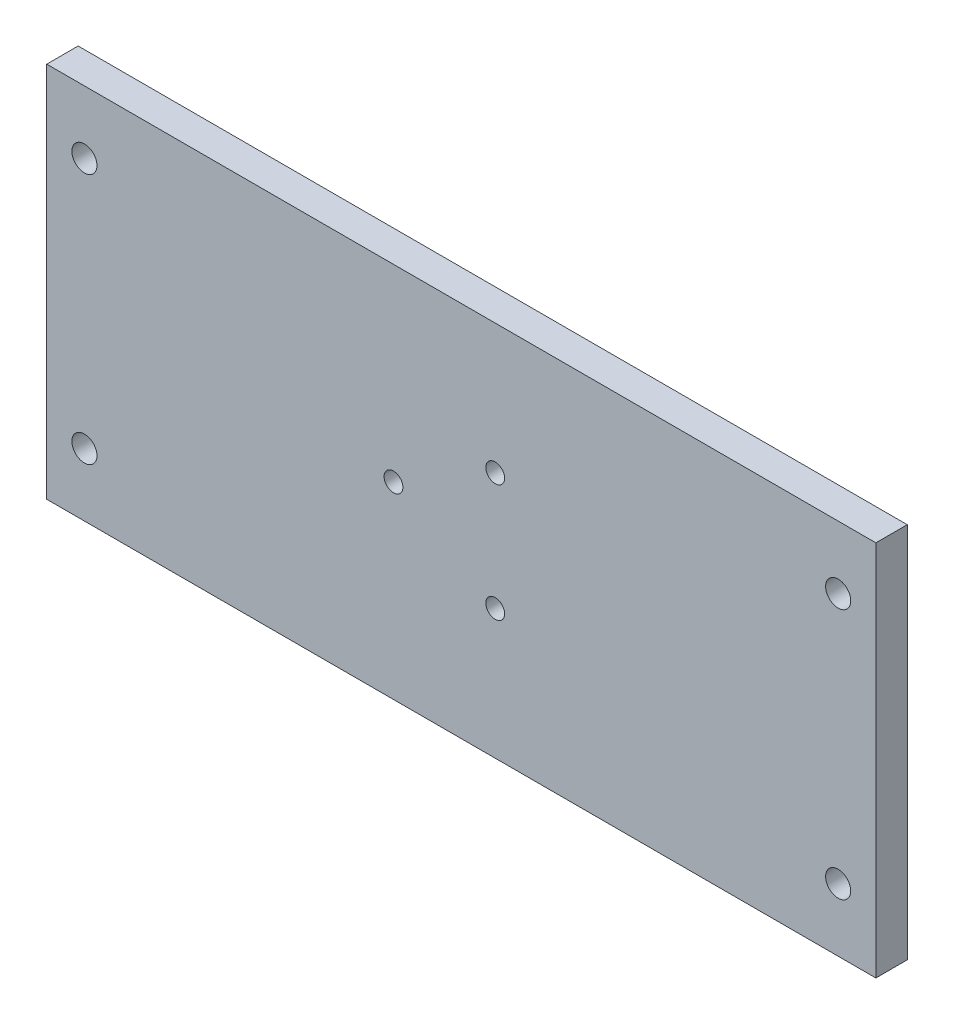
ISO-10303-21;
HEADER;
FILE_DESCRIPTION(('STEP AP214'),'2;1');
FILE_NAME('part.step','',(''),(''),'','','');
FILE_SCHEMA(('AUTOMOTIVE_DESIGN { 1 0 10303 214 1 1 1 1 }'));
ENDSEC;
DATA;
#1=APPLICATION_CONTEXT('core data for automotive mechanical design processes');
#2=APPLICATION_PROTOCOL_DEFINITION('international standard','automotive_design',2000,#1);
#3=PRODUCT_CONTEXT('',#1,'mechanical');
#4=PRODUCT('Part','Part','',(#3));
#5=PRODUCT_RELATED_PRODUCT_CATEGORY('part','',(#4));
#6=PRODUCT_DEFINITION_FORMATION('','',#4);
#7=PRODUCT_DEFINITION_CONTEXT('part definition',#1,'design');
#8=PRODUCT_DEFINITION('design','',#6,#7);
#9=PRODUCT_DEFINITION_SHAPE('','',#8);
#10=(LENGTH_UNIT() NAMED_UNIT(*) SI_UNIT(.MILLI.,.METRE.));
#11=(NAMED_UNIT(*) PLANE_ANGLE_UNIT() SI_UNIT($,.RADIAN.));
#12=(NAMED_UNIT(*) SI_UNIT($,.STERADIAN.) SOLID_ANGLE_UNIT());
#13=UNCERTAINTY_MEASURE_WITH_UNIT(LENGTH_MEASURE(1.E-05),#10,'distance_accuracy_value','');
#14=(GEOMETRIC_REPRESENTATION_CONTEXT(3) GLOBAL_UNCERTAINTY_ASSIGNED_CONTEXT((#13)) GLOBAL_UNIT_ASSIGNED_CONTEXT((#10,
#11,#12)) REPRESENTATION_CONTEXT('',''));
#15=CARTESIAN_POINT('',(0.,0.,0.));
#16=DIRECTION('',(0.,0.,1.));
#17=DIRECTION('',(1.,0.,0.));
#18=AXIS2_PLACEMENT_3D('',#15,#16,#17);
#19=CARTESIAN_POINT('',(-70.,30.,5.));
#20=DIRECTION('',(0.,-1.,0.));
#21=DIRECTION('',(0.,0.,-1.));
#22=AXIS2_PLACEMENT_3D('',#19,#20,#21);
#23=PLANE('',#22);
#24=DIRECTION('',(-1.,0.,0.));
#25=VECTOR('',#24,1.);
#26=CARTESIAN_POINT('',(-70.,30.,0.));
#27=LINE('',#26,#25);
#28=CARTESIAN_POINT('',(66.,30.,0.));
#29=VERTEX_POINT('',#28);
#30=CARTESIAN_POINT('',(-66.,30.,0.));
#31=VERTEX_POINT('',#30);
#32=EDGE_CURVE('E124',#29,#31,#27,.T.);
#33=ORIENTED_EDGE('',*,*,#32,.T.);
#34=DIRECTION('',(0.,0.,1.));
#35=VECTOR('',#34,1.);
#36=CARTESIAN_POINT('',(-66.,30.,0.));
#37=LINE('',#36,#35);
#38=CARTESIAN_POINT('',(-66.,30.,5.));
#39=VERTEX_POINT('',#38);
#40=EDGE_CURVE('E53',#31,#39,#37,.T.);
#41=ORIENTED_EDGE('',*,*,#40,.T.);
#42=DIRECTION('',(-1.,0.,0.));
#43=VECTOR('',#42,1.);
#44=CARTESIAN_POINT('',(-70.,30.,5.));
#45=LINE('',#44,#43);
#46=CARTESIAN_POINT('',(66.,30.,5.));
#47=VERTEX_POINT('',#46);
#48=EDGE_CURVE('E45',#47,#39,#45,.T.);
#49=ORIENTED_EDGE('',*,*,#48,.F.);
#50=DIRECTION('',(0.,0.,1.));
#51=VECTOR('',#50,1.);
#52=CARTESIAN_POINT('',(66.,30.,0.));
#53=LINE('',#52,#51);
#54=EDGE_CURVE('E94',#29,#47,#53,.T.);
#55=ORIENTED_EDGE('',*,*,#54,.F.);
#56=EDGE_LOOP('',(#33,#41,#49,#55));
#57=FACE_BOUND('',#56,.T.);
#58=ADVANCED_FACE('F37',(#57),#23,.F.);
#59=CARTESIAN_POINT('',(-70.,-30.,5.));
#60=DIRECTION('',(0.,1.,0.));
#61=DIRECTION('',(0.,0.,1.));
#62=AXIS2_PLACEMENT_3D('',#59,#60,#61);
#63=PLANE('',#62);
#64=DIRECTION('',(1.,0.,0.));
#65=VECTOR('',#64,1.);
#66=CARTESIAN_POINT('',(-70.,-30.,5.));
#67=LINE('',#66,#65);
#68=CARTESIAN_POINT('',(-66.,-30.,5.));
#69=VERTEX_POINT('',#68);
#70=CARTESIAN_POINT('',(66.,-30.,5.));
#71=VERTEX_POINT('',#70);
#72=EDGE_CURVE('E11',#69,#71,#67,.T.);
#73=ORIENTED_EDGE('',*,*,#72,.F.);
#74=DIRECTION('',(0.,0.,1.));
#75=VECTOR('',#74,1.);
#76=CARTESIAN_POINT('',(-66.,-30.,0.));
#77=LINE('',#76,#75);
#78=CARTESIAN_POINT('',(-66.,-30.,0.));
#79=VERTEX_POINT('',#78);
#80=EDGE_CURVE('E77',#79,#69,#77,.T.);
#81=ORIENTED_EDGE('',*,*,#80,.F.);
#82=DIRECTION('',(1.,0.,0.));
#83=VECTOR('',#82,1.);
#84=CARTESIAN_POINT('',(-70.,-30.,0.));
#85=LINE('',#84,#83);
#86=CARTESIAN_POINT('',(66.,-30.,0.));
#87=VERTEX_POINT('',#86);
#88=EDGE_CURVE('E40',#79,#87,#85,.T.);
#89=ORIENTED_EDGE('',*,*,#88,.T.);
#90=DIRECTION('',(0.,0.,1.));
#91=VECTOR('',#90,1.);
#92=CARTESIAN_POINT('',(66.,-30.,0.));
#93=LINE('',#92,#91);
#94=EDGE_CURVE('E61',#87,#71,#93,.T.);
#95=ORIENTED_EDGE('',*,*,#94,.T.);
#96=EDGE_LOOP('',(#73,#81,#89,#95));
#97=FACE_BOUND('',#96,.T.);
#98=ADVANCED_FACE('F93',(#97),#63,.F.);
#99=CARTESIAN_POINT('',(0.,0.,5.));
#100=DIRECTION('',(0.,0.,-1.));
#101=DIRECTION('',(-1.,0.,0.));
#102=AXIS2_PLACEMENT_3D('',#99,#100,#101);
#103=PLANE('',#102);
#104=CARTESIAN_POINT('',(5.39749999999992,-9.34874423385306,5.));
#105=DIRECTION('',(0.,0.,1.));
#106=DIRECTION('',(1.,0.,0.));
#107=AXIS2_PLACEMENT_3D('',#104,#105,#106);
#108=CIRCLE('',#107,1.5);
#109=CARTESIAN_POINT('',(6.89749999999991,-9.34874423385306,5.));
#110=VERTEX_POINT('',#109);
#111=EDGE_CURVE('E139',#110,#110,#108,.T.);
#112=ORIENTED_EDGE('',*,*,#111,.F.);
#113=EDGE_LOOP('',(#112));
#114=FACE_BOUND('',#113,.T.);
#115=CARTESIAN_POINT('',(5.39750000000004,9.34874423385299,5.));
#116=DIRECTION('',(0.,0.,1.));
#117=DIRECTION('',(1.,0.,0.));
#118=AXIS2_PLACEMENT_3D('',#115,#116,#117);
#119=CIRCLE('',#118,1.5);
#120=CARTESIAN_POINT('',(6.89750000000004,9.34874423385299,5.));
#121=VERTEX_POINT('',#120);
#122=EDGE_CURVE('E146',#121,#121,#119,.T.);
#123=ORIENTED_EDGE('',*,*,#122,.F.);
#124=EDGE_LOOP('',(#123));
#125=FACE_BOUND('',#124,.T.);
#126=CARTESIAN_POINT('',(-10.795,0.,5.));
#127=DIRECTION('',(0.,0.,1.));
#128=DIRECTION('',(1.,0.,0.));
#129=AXIS2_PLACEMENT_3D('',#126,#127,#128);
#130=CIRCLE('',#129,1.5);
#131=CARTESIAN_POINT('',(-9.295,0.,5.));
#132=VERTEX_POINT('',#131);
#133=EDGE_CURVE('E153',#132,#132,#130,.T.);
#134=ORIENTED_EDGE('',*,*,#133,.F.);
#135=EDGE_LOOP('',(#134));
#136=FACE_BOUND('',#135,.T.);
#137=CARTESIAN_POINT('',(60.,-20.,5.));
#138=DIRECTION('',(0.,0.,1.));
#139=DIRECTION('',(1.,0.,0.));
#140=AXIS2_PLACEMENT_3D('',#137,#138,#139);
#141=CIRCLE('',#140,2.);
#142=CARTESIAN_POINT('',(62.,-20.,5.));
#143=VERTEX_POINT('',#142);
#144=EDGE_CURVE('E109',#143,#143,#141,.T.);
#145=ORIENTED_EDGE('',*,*,#144,.F.);
#146=EDGE_LOOP('',(#145));
#147=FACE_BOUND('',#146,.T.);
#148=CARTESIAN_POINT('',(-60.,20.,5.));
#149=DIRECTION('',(0.,0.,1.));
#150=DIRECTION('',(1.,0.,0.));
#151=AXIS2_PLACEMENT_3D('',#148,#149,#150);
#152=CIRCLE('',#151,2.);
#153=CARTESIAN_POINT('',(-58.,20.,5.));
#154=VERTEX_POINT('',#153);
#155=EDGE_CURVE('E116',#154,#154,#152,.T.);
#156=ORIENTED_EDGE('',*,*,#155,.F.);
#157=EDGE_LOOP('',(#156));
#158=FACE_BOUND('',#157,.T.);
#159=CARTESIAN_POINT('',(-60.,-20.,5.));
#160=DIRECTION('',(0.,0.,1.));
#161=DIRECTION('',(1.,0.,0.));
#162=AXIS2_PLACEMENT_3D('',#159,#160,#161);
#163=CIRCLE('',#162,2.);
#164=CARTESIAN_POINT('',(-58.,-20.,5.));
#165=VERTEX_POINT('',#164);
#166=EDGE_CURVE('E102',#165,#165,#163,.T.);
#167=ORIENTED_EDGE('',*,*,#166,.F.);
#168=EDGE_LOOP('',(#167));
#169=FACE_BOUND('',#168,.T.);
#170=CARTESIAN_POINT('',(60.,20.,5.));
#171=DIRECTION('',(0.,0.,1.));
#172=DIRECTION('',(1.,0.,0.));
#173=AXIS2_PLACEMENT_3D('',#170,#171,#172);
#174=CIRCLE('',#173,2.);
#175=CARTESIAN_POINT('',(62.,20.,5.));
#176=VERTEX_POINT('',#175);
#177=EDGE_CURVE('E121',#176,#176,#174,.T.);
#178=ORIENTED_EDGE('',*,*,#177,.F.);
#179=EDGE_LOOP('',(#178));
#180=FACE_BOUND('',#179,.T.);
#181=ORIENTED_EDGE('',*,*,#48,.T.);
#182=DIRECTION('',(0.,1.,0.));
#183=VECTOR('',#182,1.);
#184=CARTESIAN_POINT('',(-66.,30.,5.));
#185=LINE('',#184,#183);
#186=EDGE_CURVE('E80',#69,#39,#185,.T.);
#187=ORIENTED_EDGE('',*,*,#186,.F.);
#188=ORIENTED_EDGE('',*,*,#72,.T.);
#189=DIRECTION('',(0.,-1.,0.));
#190=VECTOR('',#189,1.);
#191=CARTESIAN_POINT('',(66.,30.,5.));
#192=LINE('',#191,#190);
#193=EDGE_CURVE('E99',#47,#71,#192,.T.);
#194=ORIENTED_EDGE('',*,*,#193,.F.);
#195=EDGE_LOOP('',(#181,#187,#188,#194));
#196=FACE_BOUND('',#195,.T.);
#197=ADVANCED_FACE('F89',(#114,#125,#136,#147,#158,#169,#180,#196),#103,.F.);
#198=CARTESIAN_POINT('',(0.,0.,0.));
#199=DIRECTION('',(0.,0.,-1.));
#200=DIRECTION('',(-1.,0.,0.));
#201=AXIS2_PLACEMENT_3D('',#198,#199,#200);
#202=PLANE('',#201);
#203=CARTESIAN_POINT('',(5.39749999999992,-9.34874423385306,0.));
#204=DIRECTION('',(0.,0.,-1.));
#205=DIRECTION('',(-1.,0.,0.));
#206=AXIS2_PLACEMENT_3D('',#203,#204,#205);
#207=CIRCLE('',#206,1.5);
#208=CARTESIAN_POINT('',(3.89749999999992,-9.34874423385306,0.));
#209=VERTEX_POINT('',#208);
#210=EDGE_CURVE('E141',#209,#209,#207,.F.);
#211=ORIENTED_EDGE('',*,*,#210,.T.);
#212=EDGE_LOOP('',(#211));
#213=FACE_BOUND('',#212,.T.);
#214=CARTESIAN_POINT('',(5.39750000000004,9.34874423385299,0.));
#215=DIRECTION('',(0.,0.,-1.));
#216=DIRECTION('',(-1.,0.,0.));
#217=AXIS2_PLACEMENT_3D('',#214,#215,#216);
#218=CIRCLE('',#217,1.5);
#219=CARTESIAN_POINT('',(3.89750000000004,9.34874423385299,0.));
#220=VERTEX_POINT('',#219);
#221=EDGE_CURVE('E151',#220,#220,#218,.F.);
#222=ORIENTED_EDGE('',*,*,#221,.T.);
#223=EDGE_LOOP('',(#222));
#224=FACE_BOUND('',#223,.T.);
#225=CARTESIAN_POINT('',(-10.795,0.,0.));
#226=DIRECTION('',(0.,0.,-1.));
#227=DIRECTION('',(-1.,0.,0.));
#228=AXIS2_PLACEMENT_3D('',#225,#226,#227);
#229=CIRCLE('',#228,1.5);
#230=CARTESIAN_POINT('',(-12.295,0.,0.));
#231=VERTEX_POINT('',#230);
#232=EDGE_CURVE('E136',#231,#231,#229,.F.);
#233=ORIENTED_EDGE('',*,*,#232,.T.);
#234=EDGE_LOOP('',(#233));
#235=FACE_BOUND('',#234,.T.);
#236=DIRECTION('',(0.,1.,0.));
#237=VECTOR('',#236,1.);
#238=CARTESIAN_POINT('',(-66.,30.,0.));
#239=LINE('',#238,#237);
#240=EDGE_CURVE('E81',#79,#31,#239,.T.);
#241=ORIENTED_EDGE('',*,*,#240,.T.);
#242=ORIENTED_EDGE('',*,*,#32,.F.);
#243=DIRECTION('',(0.,-1.,0.));
#244=VECTOR('',#243,1.);
#245=CARTESIAN_POINT('',(66.,30.,0.));
#246=LINE('',#245,#244);
#247=EDGE_CURVE('E96',#29,#87,#246,.T.);
#248=ORIENTED_EDGE('',*,*,#247,.T.);
#249=ORIENTED_EDGE('',*,*,#88,.F.);
#250=EDGE_LOOP('',(#241,#242,#248,#249));
#251=FACE_BOUND('',#250,.T.);
#252=CARTESIAN_POINT('',(60.,-20.,0.));
#253=DIRECTION('',(0.,0.,-1.));
#254=DIRECTION('',(-1.,0.,0.));
#255=AXIS2_PLACEMENT_3D('',#252,#253,#254);
#256=CIRCLE('',#255,2.);
#257=CARTESIAN_POINT('',(58.,-20.,0.));
#258=VERTEX_POINT('',#257);
#259=EDGE_CURVE('E113',#258,#258,#256,.F.);
#260=ORIENTED_EDGE('',*,*,#259,.T.);
#261=EDGE_LOOP('',(#260));
#262=FACE_BOUND('',#261,.T.);
#263=CARTESIAN_POINT('',(-60.,20.,0.));
#264=DIRECTION('',(0.,0.,-1.));
#265=DIRECTION('',(-1.,0.,0.));
#266=AXIS2_PLACEMENT_3D('',#263,#264,#265);
#267=CIRCLE('',#266,2.);
#268=CARTESIAN_POINT('',(-62.,20.,0.));
#269=VERTEX_POINT('',#268);
#270=EDGE_CURVE('E105',#269,#269,#267,.F.);
#271=ORIENTED_EDGE('',*,*,#270,.T.);
#272=EDGE_LOOP('',(#271));
#273=FACE_BOUND('',#272,.T.);
#274=CARTESIAN_POINT('',(-60.,-20.,0.));
#275=DIRECTION('',(0.,0.,-1.));
#276=DIRECTION('',(-1.,0.,0.));
#277=AXIS2_PLACEMENT_3D('',#274,#275,#276);
#278=CIRCLE('',#277,2.);
#279=CARTESIAN_POINT('',(-62.,-20.,0.));
#280=VERTEX_POINT('',#279);
#281=EDGE_CURVE('E106',#280,#280,#278,.F.);
#282=ORIENTED_EDGE('',*,*,#281,.T.);
#283=EDGE_LOOP('',(#282));
#284=FACE_BOUND('',#283,.T.);
#285=CARTESIAN_POINT('',(60.,20.,0.));
#286=DIRECTION('',(0.,0.,-1.));
#287=DIRECTION('',(-1.,0.,0.));
#288=AXIS2_PLACEMENT_3D('',#285,#286,#287);
#289=CIRCLE('',#288,2.);
#290=CARTESIAN_POINT('',(58.,20.,0.));
#291=VERTEX_POINT('',#290);
#292=EDGE_CURVE('E112',#291,#291,#289,.F.);
#293=ORIENTED_EDGE('',*,*,#292,.T.);
#294=EDGE_LOOP('',(#293));
#295=FACE_BOUND('',#294,.T.);
#296=ADVANCED_FACE('F132',(#213,#224,#235,#251,#262,#273,#284,#295),#202,.T.);
#297=CARTESIAN_POINT('',(60.,20.,-0.00100000000000013));
#298=DIRECTION('',(0.,0.,1.));
#299=DIRECTION('',(1.,0.,0.));
#300=AXIS2_PLACEMENT_3D('',#297,#298,#299);
#301=CYLINDRICAL_SURFACE('',#300,2.);
#302=ORIENTED_EDGE('',*,*,#292,.F.);
#303=EDGE_LOOP('',(#302));
#304=FACE_BOUND('',#303,.T.);
#305=ORIENTED_EDGE('',*,*,#177,.T.);
#306=EDGE_LOOP('',(#305));
#307=FACE_BOUND('',#306,.T.);
#308=ADVANCED_FACE('F185',(#304,#307),#301,.F.);
#309=CARTESIAN_POINT('',(-60.,-20.,-0.00100000000000013));
#310=DIRECTION('',(0.,0.,1.));
#311=DIRECTION('',(1.,0.,0.));
#312=AXIS2_PLACEMENT_3D('',#309,#310,#311);
#313=CYLINDRICAL_SURFACE('',#312,2.);
#314=ORIENTED_EDGE('',*,*,#281,.F.);
#315=EDGE_LOOP('',(#314));
#316=FACE_BOUND('',#315,.T.);
#317=ORIENTED_EDGE('',*,*,#166,.T.);
#318=EDGE_LOOP('',(#317));
#319=FACE_BOUND('',#318,.T.);
#320=ADVANCED_FACE('F190',(#316,#319),#313,.F.);
#321=CARTESIAN_POINT('',(-60.,20.,-0.00100000000000013));
#322=DIRECTION('',(0.,0.,1.));
#323=DIRECTION('',(1.,0.,0.));
#324=AXIS2_PLACEMENT_3D('',#321,#322,#323);
#325=CYLINDRICAL_SURFACE('',#324,2.);
#326=ORIENTED_EDGE('',*,*,#270,.F.);
#327=EDGE_LOOP('',(#326));
#328=FACE_BOUND('',#327,.T.);
#329=ORIENTED_EDGE('',*,*,#155,.T.);
#330=EDGE_LOOP('',(#329));
#331=FACE_BOUND('',#330,.T.);
#332=ADVANCED_FACE('F192',(#328,#331),#325,.F.);
#333=CARTESIAN_POINT('',(60.,-20.,-0.00100000000000013));
#334=DIRECTION('',(0.,0.,1.));
#335=DIRECTION('',(1.,0.,0.));
#336=AXIS2_PLACEMENT_3D('',#333,#334,#335);
#337=CYLINDRICAL_SURFACE('',#336,2.);
#338=ORIENTED_EDGE('',*,*,#259,.F.);
#339=EDGE_LOOP('',(#338));
#340=FACE_BOUND('',#339,.T.);
#341=ORIENTED_EDGE('',*,*,#144,.T.);
#342=EDGE_LOOP('',(#341));
#343=FACE_BOUND('',#342,.T.);
#344=ADVANCED_FACE('F195',(#340,#343),#337,.F.);
#345=CARTESIAN_POINT('',(66.,30.,0.));
#346=DIRECTION('',(-1.,0.,0.));
#347=DIRECTION('',(0.,0.,1.));
#348=AXIS2_PLACEMENT_3D('',#345,#346,#347);
#349=PLANE('',#348);
#350=ORIENTED_EDGE('',*,*,#193,.T.);
#351=ORIENTED_EDGE('',*,*,#94,.F.);
#352=ORIENTED_EDGE('',*,*,#247,.F.);
#353=ORIENTED_EDGE('',*,*,#54,.T.);
#354=EDGE_LOOP('',(#350,#351,#352,#353));
#355=FACE_BOUND('',#354,.T.);
#356=ADVANCED_FACE('F172',(#355),#349,.F.);
#357=CARTESIAN_POINT('',(-66.,30.,0.));
#358=DIRECTION('',(1.,0.,0.));
#359=DIRECTION('',(0.,0.,-1.));
#360=AXIS2_PLACEMENT_3D('',#357,#358,#359);
#361=PLANE('',#360);
#362=ORIENTED_EDGE('',*,*,#186,.T.);
#363=ORIENTED_EDGE('',*,*,#40,.F.);
#364=ORIENTED_EDGE('',*,*,#240,.F.);
#365=ORIENTED_EDGE('',*,*,#80,.T.);
#366=EDGE_LOOP('',(#362,#363,#364,#365));
#367=FACE_BOUND('',#366,.T.);
#368=ADVANCED_FACE('F79',(#367),#361,.F.);
#369=CARTESIAN_POINT('',(-10.795,0.,-0.00100000000000013));
#370=DIRECTION('',(0.,0.,1.));
#371=DIRECTION('',(1.,0.,0.));
#372=AXIS2_PLACEMENT_3D('',#369,#370,#371);
#373=CYLINDRICAL_SURFACE('',#372,1.5);
#374=ORIENTED_EDGE('',*,*,#232,.F.);
#375=EDGE_LOOP('',(#374));
#376=FACE_BOUND('',#375,.T.);
#377=ORIENTED_EDGE('',*,*,#133,.T.);
#378=EDGE_LOOP('',(#377));
#379=FACE_BOUND('',#378,.T.);
#380=ADVANCED_FACE('F161',(#376,#379),#373,.F.);
#381=CARTESIAN_POINT('',(5.39750000000004,9.34874423385299,-0.00100000000000013));
#382=DIRECTION('',(0.,0.,1.));
#383=DIRECTION('',(1.,0.,0.));
#384=AXIS2_PLACEMENT_3D('',#381,#382,#383);
#385=CYLINDRICAL_SURFACE('',#384,1.5);
#386=ORIENTED_EDGE('',*,*,#221,.F.);
#387=EDGE_LOOP('',(#386));
#388=FACE_BOUND('',#387,.T.);
#389=ORIENTED_EDGE('',*,*,#122,.T.);
#390=EDGE_LOOP('',(#389));
#391=FACE_BOUND('',#390,.T.);
#392=ADVANCED_FACE('F163',(#388,#391),#385,.F.);
#393=CARTESIAN_POINT('',(5.39749999999992,-9.34874423385306,-0.00100000000000013));
#394=DIRECTION('',(0.,0.,1.));
#395=DIRECTION('',(1.,0.,0.));
#396=AXIS2_PLACEMENT_3D('',#393,#394,#395);
#397=CYLINDRICAL_SURFACE('',#396,1.5);
#398=ORIENTED_EDGE('',*,*,#210,.F.);
#399=EDGE_LOOP('',(#398));
#400=FACE_BOUND('',#399,.T.);
#401=ORIENTED_EDGE('',*,*,#111,.T.);
#402=EDGE_LOOP('',(#401));
#403=FACE_BOUND('',#402,.T.);
#404=ADVANCED_FACE('F169',(#400,#403),#397,.F.);
#405=CLOSED_SHELL('',(#58,#98,#197,#296,#308,#320,#332,#344,#356,#368,#380,#392,#404));
#406=MANIFOLD_SOLID_BREP('B2',#405);
#407=ADVANCED_BREP_SHAPE_REPRESENTATION('',(#18,#406),#14);
#408=SHAPE_DEFINITION_REPRESENTATION(#9,#407);
ENDSEC;
END-ISO-10303-21;
